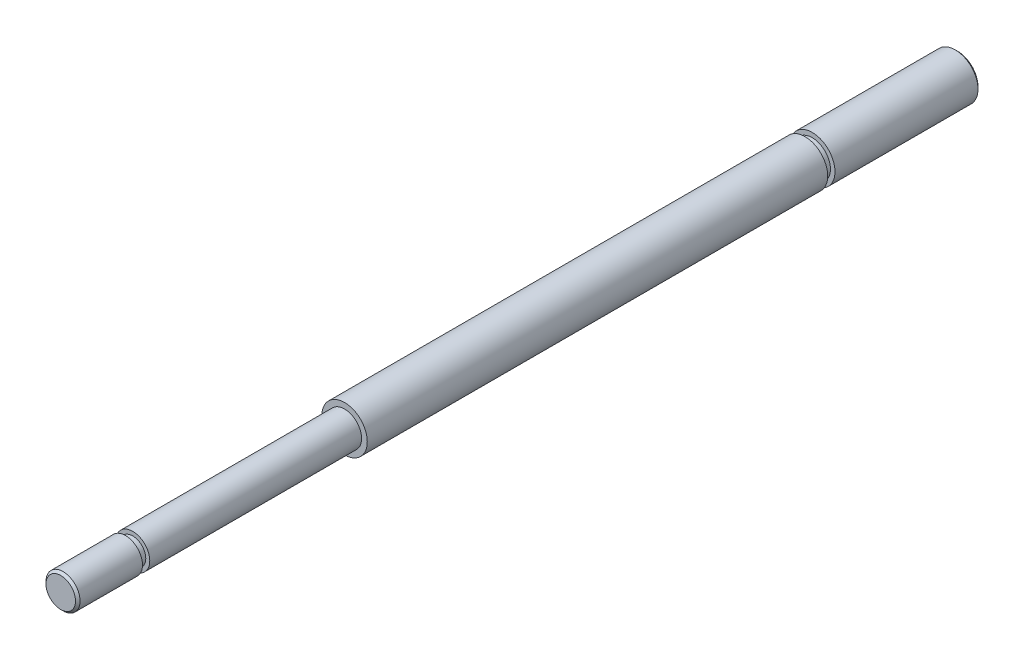
ISO-10303-21;
HEADER;
FILE_DESCRIPTION(('STEP AP214'),'2;1');
FILE_NAME('part.step','',(''),(''),'','','');
FILE_SCHEMA(('AUTOMOTIVE_DESIGN { 1 0 10303 214 1 1 1 1 }'));
ENDSEC;
DATA;
#1=APPLICATION_CONTEXT('core data for automotive mechanical design processes');
#2=APPLICATION_PROTOCOL_DEFINITION('international standard','automotive_design',2000,#1);
#3=PRODUCT_CONTEXT('',#1,'mechanical');
#4=PRODUCT('Part','Part','',(#3));
#5=PRODUCT_RELATED_PRODUCT_CATEGORY('part','',(#4));
#6=PRODUCT_DEFINITION_FORMATION('','',#4);
#7=PRODUCT_DEFINITION_CONTEXT('part definition',#1,'design');
#8=PRODUCT_DEFINITION('design','',#6,#7);
#9=PRODUCT_DEFINITION_SHAPE('','',#8);
#10=(LENGTH_UNIT() NAMED_UNIT(*) SI_UNIT(.MILLI.,.METRE.));
#11=(NAMED_UNIT(*) PLANE_ANGLE_UNIT() SI_UNIT($,.RADIAN.));
#12=(NAMED_UNIT(*) SI_UNIT($,.STERADIAN.) SOLID_ANGLE_UNIT());
#13=UNCERTAINTY_MEASURE_WITH_UNIT(LENGTH_MEASURE(1.E-05),#10,'distance_accuracy_value','');
#14=(GEOMETRIC_REPRESENTATION_CONTEXT(3) GLOBAL_UNCERTAINTY_ASSIGNED_CONTEXT((#13)) GLOBAL_UNIT_ASSIGNED_CONTEXT((#10,
#11,#12)) REPRESENTATION_CONTEXT('',''));
#15=CARTESIAN_POINT('',(0.,0.,0.));
#16=DIRECTION('',(0.,0.,1.));
#17=DIRECTION('',(1.,0.,0.));
#18=AXIS2_PLACEMENT_3D('',#15,#16,#17);
#19=CARTESIAN_POINT('',(0.,0.,79.));
#20=DIRECTION('',(0.,0.,-1.));
#21=DIRECTION('',(-1.,0.,0.));
#22=AXIS2_PLACEMENT_3D('',#19,#20,#21);
#23=CYLINDRICAL_SURFACE('',#22,1.5);
#24=CARTESIAN_POINT('',(0.,0.,54.));
#25=DIRECTION('',(0.,0.,1.));
#26=DIRECTION('',(1.,0.,0.));
#27=AXIS2_PLACEMENT_3D('',#24,#25,#26);
#28=CIRCLE('',#27,1.5);
#29=CARTESIAN_POINT('',(1.5,0.,54.));
#30=VERTEX_POINT('',#29);
#31=EDGE_CURVE('E52',#30,#30,#28,.T.);
#32=ORIENTED_EDGE('',*,*,#31,.T.);
#33=EDGE_LOOP('',(#32));
#34=FACE_BOUND('',#33,.T.);
#35=CARTESIAN_POINT('',(0.,0.,72.66));
#36=DIRECTION('',(0.,0.,1.));
#37=DIRECTION('',(1.,0.,0.));
#38=AXIS2_PLACEMENT_3D('',#35,#36,#37);
#39=CIRCLE('',#38,1.5);
#40=CARTESIAN_POINT('',(1.5,0.,72.66));
#41=VERTEX_POINT('',#40);
#42=EDGE_CURVE('E53',#41,#41,#39,.T.);
#43=ORIENTED_EDGE('',*,*,#42,.F.);
#44=EDGE_LOOP('',(#43));
#45=FACE_BOUND('',#44,.T.);
#46=ADVANCED_FACE('F29',(#34,#45),#23,.T.);
#47=CARTESIAN_POINT('',(0.,0.,54.));
#48=DIRECTION('',(0.,0.,-1.));
#49=DIRECTION('',(-1.,0.,0.));
#50=AXIS2_PLACEMENT_3D('',#47,#48,#49);
#51=CYLINDRICAL_SURFACE('',#50,2.);
#52=CARTESIAN_POINT('',(0.,0.,54.));
#53=DIRECTION('',(0.,0.,1.));
#54=DIRECTION('',(1.,0.,0.));
#55=AXIS2_PLACEMENT_3D('',#52,#53,#54);
#56=CIRCLE('',#55,2.);
#57=CARTESIAN_POINT('',(2.,0.,54.));
#58=VERTEX_POINT('',#57);
#59=EDGE_CURVE('E74',#58,#58,#56,.T.);
#60=ORIENTED_EDGE('',*,*,#59,.F.);
#61=EDGE_LOOP('',(#60));
#62=FACE_BOUND('',#61,.T.);
#63=CARTESIAN_POINT('',(0.,0.,13.44));
#64=DIRECTION('',(0.,0.,-1.));
#65=DIRECTION('',(-1.,0.,0.));
#66=AXIS2_PLACEMENT_3D('',#63,#64,#65);
#67=CIRCLE('',#66,2.);
#68=CARTESIAN_POINT('',(-2.,0.,13.44));
#69=VERTEX_POINT('',#68);
#70=EDGE_CURVE('E49',#69,#69,#67,.T.);
#71=ORIENTED_EDGE('',*,*,#70,.F.);
#72=EDGE_LOOP('',(#71));
#73=FACE_BOUND('',#72,.T.);
#74=ADVANCED_FACE('F31',(#62,#73),#51,.T.);
#75=CARTESIAN_POINT('',(0.,0.,54.));
#76=DIRECTION('',(0.,0.,1.));
#77=DIRECTION('',(1.,0.,0.));
#78=AXIS2_PLACEMENT_3D('',#75,#76,#77);
#79=PLANE('',#78);
#80=ORIENTED_EDGE('',*,*,#59,.T.);
#81=EDGE_LOOP('',(#80));
#82=FACE_BOUND('',#81,.T.);
#83=ORIENTED_EDGE('',*,*,#31,.F.);
#84=EDGE_LOOP('',(#83));
#85=FACE_BOUND('',#84,.T.);
#86=ADVANCED_FACE('F107',(#82,#85),#79,.T.);
#87=CARTESIAN_POINT('',(0.,4.00347490347491,13.44));
#88=DIRECTION('',(0.,0.,-1.));
#89=DIRECTION('',(-1.,0.,0.));
#90=AXIS2_PLACEMENT_3D('',#87,#88,#89);
#91=PLANE('',#90);
#92=CARTESIAN_POINT('',(0.,0.,13.44));
#93=DIRECTION('',(0.,0.,1.));
#94=DIRECTION('',(1.,0.,0.));
#95=AXIS2_PLACEMENT_3D('',#92,#93,#94);
#96=CIRCLE('',#95,1.6);
#97=CARTESIAN_POINT('',(1.6,0.,13.44));
#98=VERTEX_POINT('',#97);
#99=EDGE_CURVE('E50',#98,#98,#96,.T.);
#100=ORIENTED_EDGE('',*,*,#99,.T.);
#101=EDGE_LOOP('',(#100));
#102=FACE_BOUND('',#101,.T.);
#103=ORIENTED_EDGE('',*,*,#70,.T.);
#104=EDGE_LOOP('',(#103));
#105=FACE_BOUND('',#104,.T.);
#106=ADVANCED_FACE('F195',(#102,#105),#91,.T.);
#107=CARTESIAN_POINT('',(0.,4.00347490347491,12.8));
#108=DIRECTION('',(0.,0.,1.));
#109=DIRECTION('',(1.,0.,0.));
#110=AXIS2_PLACEMENT_3D('',#107,#108,#109);
#111=PLANE('',#110);
#112=CARTESIAN_POINT('',(0.,0.,12.8));
#113=DIRECTION('',(0.,0.,1.));
#114=DIRECTION('',(1.,0.,0.));
#115=AXIS2_PLACEMENT_3D('',#112,#113,#114);
#116=CIRCLE('',#115,1.6);
#117=CARTESIAN_POINT('',(1.6,0.,12.8));
#118=VERTEX_POINT('',#117);
#119=EDGE_CURVE('E59',#118,#118,#116,.T.);
#120=ORIENTED_EDGE('',*,*,#119,.F.);
#121=EDGE_LOOP('',(#120));
#122=FACE_BOUND('',#121,.T.);
#123=CARTESIAN_POINT('',(0.,0.,12.8));
#124=DIRECTION('',(0.,0.,1.));
#125=DIRECTION('',(1.,0.,0.));
#126=AXIS2_PLACEMENT_3D('',#123,#124,#125);
#127=CIRCLE('',#126,2.);
#128=CARTESIAN_POINT('',(2.,0.,12.8));
#129=VERTEX_POINT('',#128);
#130=EDGE_CURVE('E46',#129,#129,#127,.T.);
#131=ORIENTED_EDGE('',*,*,#130,.T.);
#132=EDGE_LOOP('',(#131));
#133=FACE_BOUND('',#132,.T.);
#134=ADVANCED_FACE('F185',(#122,#133),#111,.T.);
#135=CARTESIAN_POINT('',(0.,0.,0.));
#136=DIRECTION('',(0.,0.,1.));
#137=DIRECTION('',(1.,0.,0.));
#138=AXIS2_PLACEMENT_3D('',#135,#136,#137);
#139=CYLINDRICAL_SURFACE('',#138,1.6);
#140=ORIENTED_EDGE('',*,*,#119,.T.);
#141=EDGE_LOOP('',(#140));
#142=FACE_BOUND('',#141,.T.);
#143=ORIENTED_EDGE('',*,*,#99,.F.);
#144=EDGE_LOOP('',(#143));
#145=FACE_BOUND('',#144,.T.);
#146=ADVANCED_FACE('F178',(#142,#145),#139,.T.);
#147=CARTESIAN_POINT('',(0.,0.,0.));
#148=DIRECTION('',(0.,0.,1.));
#149=DIRECTION('',(1.,0.,0.));
#150=AXIS2_PLACEMENT_3D('',#147,#148,#149);
#151=PLANE('',#150);
#152=CARTESIAN_POINT('',(0.,0.,0.));
#153=DIRECTION('',(0.,0.,1.));
#154=DIRECTION('',(1.,0.,0.));
#155=AXIS2_PLACEMENT_3D('',#152,#153,#154);
#156=CIRCLE('',#155,1.8);
#157=CARTESIAN_POINT('',(1.8,0.,0.));
#158=VERTEX_POINT('',#157);
#159=EDGE_CURVE('E10',#158,#158,#156,.F.);
#160=ORIENTED_EDGE('',*,*,#159,.T.);
#161=EDGE_LOOP('',(#160));
#162=FACE_BOUND('',#161,.T.);
#163=ADVANCED_FACE('F168',(#162),#151,.F.);
#164=CARTESIAN_POINT('',(0.,0.,0.200000000000006));
#165=DIRECTION('',(0.,0.,1.));
#166=DIRECTION('',(1.,0.,0.));
#167=AXIS2_PLACEMENT_3D('',#164,#165,#166);
#168=CONICAL_SURFACE('',#167,2.,0.785398163397438);
#169=ORIENTED_EDGE('',*,*,#159,.F.);
#170=EDGE_LOOP('',(#169));
#171=FACE_BOUND('',#170,.T.);
#172=CARTESIAN_POINT('',(0.,0.,0.200000000000006));
#173=DIRECTION('',(0.,0.,1.));
#174=DIRECTION('',(1.,0.,0.));
#175=AXIS2_PLACEMENT_3D('',#172,#173,#174);
#176=CIRCLE('',#175,2.);
#177=CARTESIAN_POINT('',(2.,0.,0.200000000000006));
#178=VERTEX_POINT('',#177);
#179=EDGE_CURVE('E37',#178,#178,#176,.T.);
#180=ORIENTED_EDGE('',*,*,#179,.F.);
#181=EDGE_LOOP('',(#180));
#182=FACE_BOUND('',#181,.T.);
#183=ADVANCED_FACE('F159',(#171,#182),#168,.T.);
#184=ORIENTED_EDGE('',*,*,#179,.T.);
#185=EDGE_LOOP('',(#184));
#186=FACE_BOUND('',#185,.T.);
#187=ORIENTED_EDGE('',*,*,#130,.F.);
#188=EDGE_LOOP('',(#187));
#189=FACE_BOUND('',#188,.T.);
#190=ADVANCED_FACE('F109',(#186,#189),#51,.T.);
#191=CARTESIAN_POINT('',(0.,3.88402273402273,73.3));
#192=DIRECTION('',(0.,0.,-1.));
#193=DIRECTION('',(-1.,0.,0.));
#194=AXIS2_PLACEMENT_3D('',#191,#192,#193);
#195=PLANE('',#194);
#196=CARTESIAN_POINT('',(0.,0.,73.3));
#197=DIRECTION('',(0.,0.,1.));
#198=DIRECTION('',(1.,0.,0.));
#199=AXIS2_PLACEMENT_3D('',#196,#197,#198);
#200=CIRCLE('',#199,1.15);
#201=CARTESIAN_POINT('',(1.15,0.,73.3));
#202=VERTEX_POINT('',#201);
#203=EDGE_CURVE('E55',#202,#202,#200,.T.);
#204=ORIENTED_EDGE('',*,*,#203,.T.);
#205=EDGE_LOOP('',(#204));
#206=FACE_BOUND('',#205,.T.);
#207=CARTESIAN_POINT('',(0.,0.,73.3));
#208=DIRECTION('',(0.,0.,-1.));
#209=DIRECTION('',(-1.,0.,0.));
#210=AXIS2_PLACEMENT_3D('',#207,#208,#209);
#211=CIRCLE('',#210,1.5);
#212=CARTESIAN_POINT('',(-1.5,0.,73.3));
#213=VERTEX_POINT('',#212);
#214=EDGE_CURVE('E33',#213,#213,#211,.T.);
#215=ORIENTED_EDGE('',*,*,#214,.T.);
#216=EDGE_LOOP('',(#215));
#217=FACE_BOUND('',#216,.T.);
#218=ADVANCED_FACE('F140',(#206,#217),#195,.T.);
#219=CARTESIAN_POINT('',(0.,3.88402273402273,72.66));
#220=DIRECTION('',(0.,0.,1.));
#221=DIRECTION('',(1.,0.,0.));
#222=AXIS2_PLACEMENT_3D('',#219,#220,#221);
#223=PLANE('',#222);
#224=CARTESIAN_POINT('',(0.,0.,72.66));
#225=DIRECTION('',(0.,0.,1.));
#226=DIRECTION('',(1.,0.,0.));
#227=AXIS2_PLACEMENT_3D('',#224,#225,#226);
#228=CIRCLE('',#227,1.15);
#229=CARTESIAN_POINT('',(1.15,0.,72.66));
#230=VERTEX_POINT('',#229);
#231=EDGE_CURVE('E61',#230,#230,#228,.T.);
#232=ORIENTED_EDGE('',*,*,#231,.F.);
#233=EDGE_LOOP('',(#232));
#234=FACE_BOUND('',#233,.T.);
#235=ORIENTED_EDGE('',*,*,#42,.T.);
#236=EDGE_LOOP('',(#235));
#237=FACE_BOUND('',#236,.T.);
#238=ADVANCED_FACE('F98',(#234,#237),#223,.T.);
#239=CARTESIAN_POINT('',(0.,0.,0.));
#240=DIRECTION('',(0.,0.,1.));
#241=DIRECTION('',(1.,0.,0.));
#242=AXIS2_PLACEMENT_3D('',#239,#240,#241);
#243=CYLINDRICAL_SURFACE('',#242,1.15);
#244=ORIENTED_EDGE('',*,*,#231,.T.);
#245=EDGE_LOOP('',(#244));
#246=FACE_BOUND('',#245,.T.);
#247=ORIENTED_EDGE('',*,*,#203,.F.);
#248=EDGE_LOOP('',(#247));
#249=FACE_BOUND('',#248,.T.);
#250=ADVANCED_FACE('F93',(#246,#249),#243,.T.);
#251=CARTESIAN_POINT('',(0.,0.,79.));
#252=DIRECTION('',(0.,0.,1.));
#253=DIRECTION('',(1.,0.,0.));
#254=AXIS2_PLACEMENT_3D('',#251,#252,#253);
#255=PLANE('',#254);
#256=CARTESIAN_POINT('',(0.,0.,79.));
#257=DIRECTION('',(0.,0.,1.));
#258=DIRECTION('',(1.,0.,0.));
#259=AXIS2_PLACEMENT_3D('',#256,#257,#258);
#260=CIRCLE('',#259,1.3);
#261=CARTESIAN_POINT('',(1.3,0.,79.));
#262=VERTEX_POINT('',#261);
#263=EDGE_CURVE('E77',#262,#262,#260,.T.);
#264=ORIENTED_EDGE('',*,*,#263,.T.);
#265=EDGE_LOOP('',(#264));
#266=FACE_BOUND('',#265,.T.);
#267=ADVANCED_FACE('F88',(#266),#255,.T.);
#268=CARTESIAN_POINT('',(0.,0.,79.));
#269=DIRECTION('',(0.,0.,-1.));
#270=DIRECTION('',(-1.,0.,0.));
#271=AXIS2_PLACEMENT_3D('',#268,#269,#270);
#272=CONICAL_SURFACE('',#271,1.3,0.785398163397443);
#273=CARTESIAN_POINT('',(0.,0.,78.8));
#274=DIRECTION('',(0.,0.,1.));
#275=DIRECTION('',(1.,0.,0.));
#276=AXIS2_PLACEMENT_3D('',#273,#274,#275);
#277=CIRCLE('',#276,1.5);
#278=CARTESIAN_POINT('',(1.5,0.,78.8));
#279=VERTEX_POINT('',#278);
#280=EDGE_CURVE('E42',#279,#279,#277,.F.);
#281=ORIENTED_EDGE('',*,*,#280,.F.);
#282=EDGE_LOOP('',(#281));
#283=FACE_BOUND('',#282,.T.);
#284=ORIENTED_EDGE('',*,*,#263,.F.);
#285=EDGE_LOOP('',(#284));
#286=FACE_BOUND('',#285,.T.);
#287=ADVANCED_FACE('F85',(#283,#286),#272,.T.);
#288=ORIENTED_EDGE('',*,*,#280,.T.);
#289=EDGE_LOOP('',(#288));
#290=FACE_BOUND('',#289,.T.);
#291=ORIENTED_EDGE('',*,*,#214,.F.);
#292=EDGE_LOOP('',(#291));
#293=FACE_BOUND('',#292,.T.);
#294=ADVANCED_FACE('F82',(#290,#293),#23,.T.);
#295=CLOSED_SHELL('',(#46,#74,#86,#106,#134,#146,#163,#183,#190,#218,#238,#250,#267,#287,#294));
#296=MANIFOLD_SOLID_BREP('B2',#295);
#297=ADVANCED_BREP_SHAPE_REPRESENTATION('',(#18,#296),#14);
#298=SHAPE_DEFINITION_REPRESENTATION(#9,#297);
ENDSEC;
END-ISO-10303-21;
